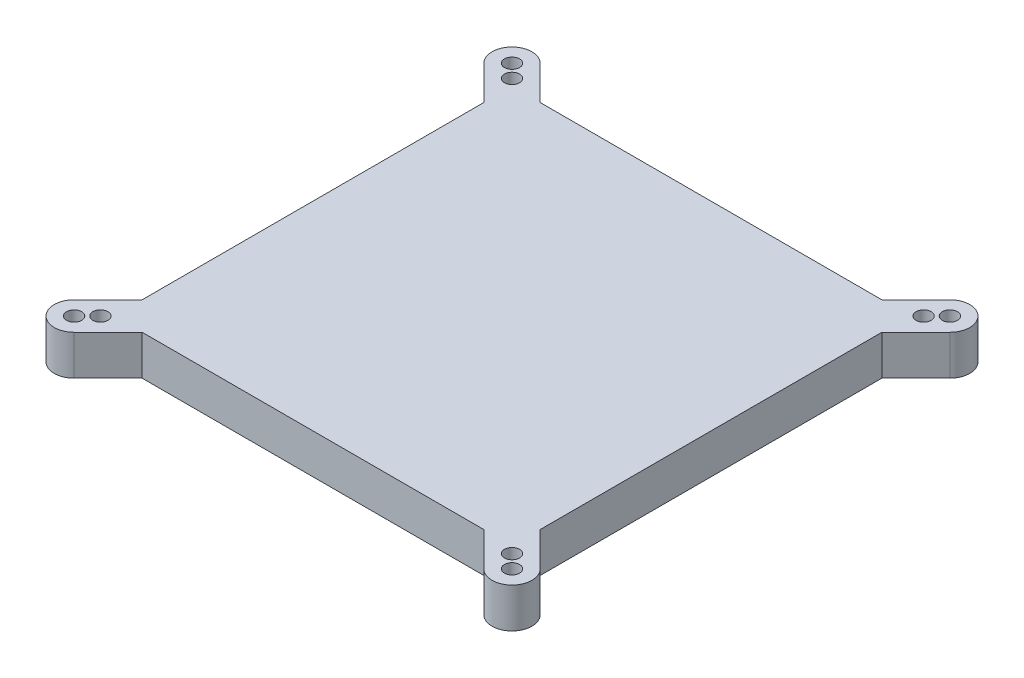
ISO-10303-21;
HEADER;
FILE_DESCRIPTION(('STEP AP214'),'2;1');
FILE_NAME('part.step','',(''),(''),'','','');
FILE_SCHEMA(('AUTOMOTIVE_DESIGN { 1 0 10303 214 1 1 1 1 }'));
ENDSEC;
DATA;
#1=APPLICATION_CONTEXT('core data for automotive mechanical design processes');
#2=APPLICATION_PROTOCOL_DEFINITION('international standard','automotive_design',2000,#1);
#3=PRODUCT_CONTEXT('',#1,'mechanical');
#4=PRODUCT('Part','Part','',(#3));
#5=PRODUCT_RELATED_PRODUCT_CATEGORY('part','',(#4));
#6=PRODUCT_DEFINITION_FORMATION('','',#4);
#7=PRODUCT_DEFINITION_CONTEXT('part definition',#1,'design');
#8=PRODUCT_DEFINITION('design','',#6,#7);
#9=PRODUCT_DEFINITION_SHAPE('','',#8);
#10=(LENGTH_UNIT() NAMED_UNIT(*) SI_UNIT(.MILLI.,.METRE.));
#11=(NAMED_UNIT(*) PLANE_ANGLE_UNIT() SI_UNIT($,.RADIAN.));
#12=(NAMED_UNIT(*) SI_UNIT($,.STERADIAN.) SOLID_ANGLE_UNIT());
#13=UNCERTAINTY_MEASURE_WITH_UNIT(LENGTH_MEASURE(1.E-05),#10,'distance_accuracy_value','');
#14=(GEOMETRIC_REPRESENTATION_CONTEXT(3) GLOBAL_UNCERTAINTY_ASSIGNED_CONTEXT((#13)) GLOBAL_UNIT_ASSIGNED_CONTEXT((#10,
#11,#12)) REPRESENTATION_CONTEXT('',''));
#15=CARTESIAN_POINT('',(0.,0.,0.));
#16=DIRECTION('',(0.,0.,1.));
#17=DIRECTION('',(1.,0.,0.));
#18=AXIS2_PLACEMENT_3D('',#15,#16,#17);
#19=CARTESIAN_POINT('',(200.,20.,0.));
#20=DIRECTION('',(-1.,0.,0.));
#21=DIRECTION('',(0.,0.,1.));
#22=AXIS2_PLACEMENT_3D('',#19,#20,#21);
#23=PLANE('',#22);
#24=DIRECTION('',(0.,-1.,0.));
#25=VECTOR('',#24,1.);
#26=CARTESIAN_POINT('',(200.,68.3076870304613,-185.857864376269));
#27=LINE('',#26,#25);
#28=CARTESIAN_POINT('',(200.,20.,-185.857864376269));
#29=VERTEX_POINT('',#28);
#30=CARTESIAN_POINT('',(200.,0.,-185.857864376269));
#31=VERTEX_POINT('',#30);
#32=EDGE_CURVE('E226',#29,#31,#27,.T.);
#33=ORIENTED_EDGE('',*,*,#32,.F.);
#34=DIRECTION('',(0.,0.,-1.));
#35=VECTOR('',#34,1.);
#36=CARTESIAN_POINT('',(200.,20.,0.));
#37=LINE('',#36,#35);
#38=CARTESIAN_POINT('',(200.,20.,-14.142135623731));
#39=VERTEX_POINT('',#38);
#40=EDGE_CURVE('E48',#39,#29,#37,.T.);
#41=ORIENTED_EDGE('',*,*,#40,.F.);
#42=DIRECTION('',(0.,-1.,0.));
#43=VECTOR('',#42,1.);
#44=CARTESIAN_POINT('',(200.,68.3076870304613,-14.142135623731));
#45=LINE('',#44,#43);
#46=CARTESIAN_POINT('',(200.,0.,-14.142135623731));
#47=VERTEX_POINT('',#46);
#48=EDGE_CURVE('E255',#39,#47,#45,.T.);
#49=ORIENTED_EDGE('',*,*,#48,.T.);
#50=DIRECTION('',(0.,0.,-1.));
#51=VECTOR('',#50,1.);
#52=CARTESIAN_POINT('',(200.,0.,0.));
#53=LINE('',#52,#51);
#54=EDGE_CURVE('E317',#47,#31,#53,.T.);
#55=ORIENTED_EDGE('',*,*,#54,.T.);
#56=EDGE_LOOP('',(#33,#41,#49,#55));
#57=FACE_BOUND('',#56,.T.);
#58=ADVANCED_FACE('F39',(#57),#23,.F.);
#59=CARTESIAN_POINT('',(0.,20.,-200.));
#60=DIRECTION('',(0.,0.,1.));
#61=DIRECTION('',(1.,0.,0.));
#62=AXIS2_PLACEMENT_3D('',#59,#60,#61);
#63=PLANE('',#62);
#64=DIRECTION('',(-1.,0.,0.));
#65=VECTOR('',#64,1.);
#66=CARTESIAN_POINT('',(0.,0.,-200.));
#67=LINE('',#66,#65);
#68=CARTESIAN_POINT('',(185.857864376269,0.,-200.));
#69=VERTEX_POINT('',#68);
#70=CARTESIAN_POINT('',(14.1421356237309,0.,-200.));
#71=VERTEX_POINT('',#70);
#72=EDGE_CURVE('E43',#69,#71,#67,.T.);
#73=ORIENTED_EDGE('',*,*,#72,.T.);
#74=DIRECTION('',(0.,-1.,0.));
#75=VECTOR('',#74,1.);
#76=CARTESIAN_POINT('',(14.142135623731,68.3076870304613,-200.));
#77=LINE('',#76,#75);
#78=CARTESIAN_POINT('',(14.1421356237309,20.,-200.));
#79=VERTEX_POINT('',#78);
#80=EDGE_CURVE('E64',#79,#71,#77,.T.);
#81=ORIENTED_EDGE('',*,*,#80,.F.);
#82=DIRECTION('',(-1.,0.,0.));
#83=VECTOR('',#82,1.);
#84=CARTESIAN_POINT('',(0.,20.,-200.));
#85=LINE('',#84,#83);
#86=CARTESIAN_POINT('',(185.857864376269,20.,-200.));
#87=VERTEX_POINT('',#86);
#88=EDGE_CURVE('E11',#87,#79,#85,.T.);
#89=ORIENTED_EDGE('',*,*,#88,.F.);
#90=DIRECTION('',(0.,-1.,0.));
#91=VECTOR('',#90,1.);
#92=CARTESIAN_POINT('',(185.857864376269,68.3076870304613,-200.));
#93=LINE('',#92,#91);
#94=EDGE_CURVE('E223',#87,#69,#93,.T.);
#95=ORIENTED_EDGE('',*,*,#94,.T.);
#96=EDGE_LOOP('',(#73,#81,#89,#95));
#97=FACE_BOUND('',#96,.T.);
#98=ADVANCED_FACE('F320',(#97),#63,.F.);
#99=CARTESIAN_POINT('',(0.,20.,0.));
#100=DIRECTION('',(1.,0.,0.));
#101=DIRECTION('',(0.,0.,-1.));
#102=AXIS2_PLACEMENT_3D('',#99,#100,#101);
#103=PLANE('',#102);
#104=DIRECTION('',(0.,0.,1.));
#105=VECTOR('',#104,1.);
#106=CARTESIAN_POINT('',(0.,20.,0.));
#107=LINE('',#106,#105);
#108=CARTESIAN_POINT('',(0.,20.,-185.857864376269));
#109=VERTEX_POINT('',#108);
#110=CARTESIAN_POINT('',(0.,20.,-14.142135623731));
#111=VERTEX_POINT('',#110);
#112=EDGE_CURVE('E56',#109,#111,#107,.T.);
#113=ORIENTED_EDGE('',*,*,#112,.F.);
#114=DIRECTION('',(0.,-1.,0.));
#115=VECTOR('',#114,1.);
#116=CARTESIAN_POINT('',(0.,68.3076870304613,-185.857864376269));
#117=LINE('',#116,#115);
#118=CARTESIAN_POINT('',(0.,0.,-185.857864376269));
#119=VERTEX_POINT('',#118);
#120=EDGE_CURVE('E170',#109,#119,#117,.T.);
#121=ORIENTED_EDGE('',*,*,#120,.T.);
#122=DIRECTION('',(0.,0.,1.));
#123=VECTOR('',#122,1.);
#124=CARTESIAN_POINT('',(0.,0.,0.));
#125=LINE('',#124,#123);
#126=CARTESIAN_POINT('',(0.,0.,-14.142135623731));
#127=VERTEX_POINT('',#126);
#128=EDGE_CURVE('E282',#119,#127,#125,.T.);
#129=ORIENTED_EDGE('',*,*,#128,.T.);
#130=DIRECTION('',(0.,-1.,0.));
#131=VECTOR('',#130,1.);
#132=CARTESIAN_POINT('',(0.,68.3076870304613,-14.142135623731));
#133=LINE('',#132,#131);
#134=EDGE_CURVE('E303',#111,#127,#133,.T.);
#135=ORIENTED_EDGE('',*,*,#134,.F.);
#136=EDGE_LOOP('',(#113,#121,#129,#135));
#137=FACE_BOUND('',#136,.T.);
#138=ADVANCED_FACE('F41',(#137),#103,.F.);
#139=CARTESIAN_POINT('',(0.,20.,0.));
#140=DIRECTION('',(0.,0.,-1.));
#141=DIRECTION('',(-1.,0.,0.));
#142=AXIS2_PLACEMENT_3D('',#139,#140,#141);
#143=PLANE('',#142);
#144=DIRECTION('',(1.,0.,0.));
#145=VECTOR('',#144,1.);
#146=CARTESIAN_POINT('',(0.,0.,0.));
#147=LINE('',#146,#145);
#148=CARTESIAN_POINT('',(14.142135623731,0.,0.));
#149=VERTEX_POINT('',#148);
#150=CARTESIAN_POINT('',(185.857864376269,0.,0.));
#151=VERTEX_POINT('',#150);
#152=EDGE_CURVE('E316',#149,#151,#147,.T.);
#153=ORIENTED_EDGE('',*,*,#152,.T.);
#154=DIRECTION('',(0.,-1.,0.));
#155=VECTOR('',#154,1.);
#156=CARTESIAN_POINT('',(185.857864376269,68.3076870304613,0.));
#157=LINE('',#156,#155);
#158=CARTESIAN_POINT('',(185.857864376269,20.,0.));
#159=VERTEX_POINT('',#158);
#160=EDGE_CURVE('E248',#159,#151,#157,.T.);
#161=ORIENTED_EDGE('',*,*,#160,.F.);
#162=DIRECTION('',(1.,0.,0.));
#163=VECTOR('',#162,1.);
#164=CARTESIAN_POINT('',(0.,20.,0.));
#165=LINE('',#164,#163);
#166=CARTESIAN_POINT('',(14.142135623731,20.,0.));
#167=VERTEX_POINT('',#166);
#168=EDGE_CURVE('E310',#167,#159,#165,.T.);
#169=ORIENTED_EDGE('',*,*,#168,.F.);
#170=DIRECTION('',(0.,-1.,0.));
#171=VECTOR('',#170,1.);
#172=CARTESIAN_POINT('',(14.142135623731,68.3076870304613,0.));
#173=LINE('',#172,#171);
#174=EDGE_CURVE('E300',#167,#149,#173,.T.);
#175=ORIENTED_EDGE('',*,*,#174,.T.);
#176=EDGE_LOOP('',(#153,#161,#169,#175));
#177=FACE_BOUND('',#176,.T.);
#178=ADVANCED_FACE('F363',(#177),#143,.F.);
#179=CARTESIAN_POINT('',(0.,20.,0.));
#180=DIRECTION('',(0.,-1.,0.));
#181=DIRECTION('',(0.,0.,-1.));
#182=AXIS2_PLACEMENT_3D('',#179,#180,#181);
#183=PLANE('',#182);
#184=DIRECTION('',(0.707106781186547,0.,0.707106781186548));
#185=VECTOR('',#184,1.);
#186=CARTESIAN_POINT('',(-7.07106781186548,20.,-192.928932188135));
#187=LINE('',#186,#185);
#188=CARTESIAN_POINT('',(-17.0876252708111,20.,-202.94548964708));
#189=VERTEX_POINT('',#188);
#190=EDGE_CURVE('E156',#189,#109,#187,.T.);
#191=ORIENTED_EDGE('',*,*,#190,.T.);
#192=ORIENTED_EDGE('',*,*,#112,.T.);
#193=DIRECTION('',(0.707106781186547,0.,-0.707106781186548));
#194=VECTOR('',#193,1.);
#195=CARTESIAN_POINT('',(-7.07106781186548,20.,-7.07106781186547));
#196=LINE('',#195,#194);
#197=CARTESIAN_POINT('',(-17.0876252708111,20.,2.94548964708019));
#198=VERTEX_POINT('',#197);
#199=EDGE_CURVE('E273',#198,#111,#196,.T.);
#200=ORIENTED_EDGE('',*,*,#199,.F.);
#201=CARTESIAN_POINT('',(-10.0165574589457,20.,10.0165574589457));
#202=DIRECTION('',(0.,-1.,0.));
#203=DIRECTION('',(0.,0.,-1.));
#204=AXIS2_PLACEMENT_3D('',#201,#202,#203);
#205=CIRCLE('',#204,10.);
#206=CARTESIAN_POINT('',(-2.9454896470802,20.,17.0876252708111));
#207=VERTEX_POINT('',#206);
#208=EDGE_CURVE('E272',#207,#198,#205,.T.);
#209=ORIENTED_EDGE('',*,*,#208,.F.);
#210=DIRECTION('',(-0.707106781186548,0.,0.707106781186547));
#211=VECTOR('',#210,1.);
#212=CARTESIAN_POINT('',(7.07106781186548,20.,7.07106781186548));
#213=LINE('',#212,#211);
#214=EDGE_CURVE('E269',#167,#207,#213,.T.);
#215=ORIENTED_EDGE('',*,*,#214,.F.);
#216=ORIENTED_EDGE('',*,*,#168,.T.);
#217=DIRECTION('',(0.707106781186548,0.,0.707106781186547));
#218=VECTOR('',#217,1.);
#219=CARTESIAN_POINT('',(192.928932188135,20.,7.07106781186548));
#220=LINE('',#219,#218);
#221=CARTESIAN_POINT('',(202.94548964708,20.,17.0876252708111));
#222=VERTEX_POINT('',#221);
#223=EDGE_CURVE('E249',#159,#222,#220,.T.);
#224=ORIENTED_EDGE('',*,*,#223,.T.);
#225=CARTESIAN_POINT('',(210.016557458946,20.,10.0165574589457));
#226=DIRECTION('',(0.,-1.,0.));
#227=DIRECTION('',(0.,0.,-1.));
#228=AXIS2_PLACEMENT_3D('',#225,#226,#227);
#229=CIRCLE('',#228,10.);
#230=CARTESIAN_POINT('',(217.087625270811,20.,2.94548964708019));
#231=VERTEX_POINT('',#230);
#232=EDGE_CURVE('E265',#222,#231,#229,.F.);
#233=ORIENTED_EDGE('',*,*,#232,.T.);
#234=DIRECTION('',(-0.707106781186547,0.,-0.707106781186548));
#235=VECTOR('',#234,1.);
#236=CARTESIAN_POINT('',(207.071067811865,20.,-7.07106781186547));
#237=LINE('',#236,#235);
#238=EDGE_CURVE('E252',#231,#39,#237,.T.);
#239=ORIENTED_EDGE('',*,*,#238,.T.);
#240=ORIENTED_EDGE('',*,*,#40,.T.);
#241=DIRECTION('',(-0.707106781186547,0.,0.707106781186548));
#242=VECTOR('',#241,1.);
#243=CARTESIAN_POINT('',(207.071067811865,20.,-192.928932188135));
#244=LINE('',#243,#242);
#245=CARTESIAN_POINT('',(217.087625270811,20.,-202.94548964708));
#246=VERTEX_POINT('',#245);
#247=EDGE_CURVE('E195',#246,#29,#244,.T.);
#248=ORIENTED_EDGE('',*,*,#247,.F.);
#249=CARTESIAN_POINT('',(210.016557458946,20.,-210.016557458946));
#250=DIRECTION('',(0.,-1.,0.));
#251=DIRECTION('',(0.,0.,-1.));
#252=AXIS2_PLACEMENT_3D('',#249,#250,#251);
#253=CIRCLE('',#252,10.);
#254=CARTESIAN_POINT('',(202.94548964708,20.,-217.087625270811));
#255=VERTEX_POINT('',#254);
#256=EDGE_CURVE('E194',#255,#246,#253,.T.);
#257=ORIENTED_EDGE('',*,*,#256,.F.);
#258=DIRECTION('',(0.707106781186548,0.,-0.707106781186547));
#259=VECTOR('',#258,1.);
#260=CARTESIAN_POINT('',(192.928932188135,20.,-207.071067811865));
#261=LINE('',#260,#259);
#262=EDGE_CURVE('E191',#87,#255,#261,.T.);
#263=ORIENTED_EDGE('',*,*,#262,.F.);
#264=ORIENTED_EDGE('',*,*,#88,.T.);
#265=DIRECTION('',(-0.707106781186548,0.,-0.707106781186547));
#266=VECTOR('',#265,1.);
#267=CARTESIAN_POINT('',(7.07106781186548,20.,-207.071067811865));
#268=LINE('',#267,#266);
#269=CARTESIAN_POINT('',(-2.9454896470802,20.,-217.087625270811));
#270=VERTEX_POINT('',#269);
#271=EDGE_CURVE('E159',#79,#270,#268,.T.);
#272=ORIENTED_EDGE('',*,*,#271,.T.);
#273=CARTESIAN_POINT('',(-10.0165574589457,20.,-210.016557458946));
#274=DIRECTION('',(0.,-1.,0.));
#275=DIRECTION('',(0.,0.,-1.));
#276=AXIS2_PLACEMENT_3D('',#273,#274,#275);
#277=CIRCLE('',#276,10.);
#278=EDGE_CURVE('E152',#270,#189,#277,.F.);
#279=ORIENTED_EDGE('',*,*,#278,.T.);
#280=EDGE_LOOP('',(#191,#192,#200,#209,#215,#216,#224,#233,#239,#240,#248,#257,#263,#264,#272,#279));
#281=FACE_BOUND('',#280,.T.);
#282=CARTESIAN_POINT('',(-3.41536736099135,20.,3.41536736099135));
#283=DIRECTION('',(0.,-1.,0.));
#284=DIRECTION('',(0.,0.,-1.));
#285=AXIS2_PLACEMENT_3D('',#282,#283,#284);
#286=CIRCLE('',#285,3.79708670005155);
#287=CARTESIAN_POINT('',(-3.41536736099135,20.,-0.381719339060196));
#288=VERTEX_POINT('',#287);
#289=EDGE_CURVE('E276',#288,#288,#286,.F.);
#290=ORIENTED_EDGE('',*,*,#289,.F.);
#291=EDGE_LOOP('',(#290));
#292=FACE_BOUND('',#291,.T.);
#293=CARTESIAN_POINT('',(-10.0165574589457,20.,10.0165574589457));
#294=DIRECTION('',(0.,-1.,0.));
#295=DIRECTION('',(0.,0.,-1.));
#296=AXIS2_PLACEMENT_3D('',#293,#294,#295);
#297=CIRCLE('',#296,3.79708670005155);
#298=CARTESIAN_POINT('',(-10.0165574589457,20.,6.21947075889412));
#299=VERTEX_POINT('',#298);
#300=EDGE_CURVE('E279',#299,#299,#297,.F.);
#301=ORIENTED_EDGE('',*,*,#300,.F.);
#302=EDGE_LOOP('',(#301));
#303=FACE_BOUND('',#302,.T.);
#304=CARTESIAN_POINT('',(210.016557458946,20.,10.0165574589457));
#305=DIRECTION('',(0.,-1.,0.));
#306=DIRECTION('',(0.,0.,-1.));
#307=AXIS2_PLACEMENT_3D('',#304,#305,#306);
#308=CIRCLE('',#307,3.79708670005155);
#309=CARTESIAN_POINT('',(210.016557458946,20.,6.21947075889412));
#310=VERTEX_POINT('',#309);
#311=EDGE_CURVE('E235',#310,#310,#308,.T.);
#312=ORIENTED_EDGE('',*,*,#311,.T.);
#313=EDGE_LOOP('',(#312));
#314=FACE_BOUND('',#313,.T.);
#315=CARTESIAN_POINT('',(203.415367360991,20.,3.41536736099135));
#316=DIRECTION('',(0.,-1.,0.));
#317=DIRECTION('',(0.,0.,-1.));
#318=AXIS2_PLACEMENT_3D('',#315,#316,#317);
#319=CIRCLE('',#318,3.79708670005155);
#320=CARTESIAN_POINT('',(203.415367360991,20.,-0.381719339060196));
#321=VERTEX_POINT('',#320);
#322=EDGE_CURVE('E262',#321,#321,#319,.T.);
#323=ORIENTED_EDGE('',*,*,#322,.T.);
#324=EDGE_LOOP('',(#323));
#325=FACE_BOUND('',#324,.T.);
#326=CARTESIAN_POINT('',(203.415367360991,20.,-203.415367360991));
#327=DIRECTION('',(0.,-1.,0.));
#328=DIRECTION('',(0.,0.,-1.));
#329=AXIS2_PLACEMENT_3D('',#326,#327,#328);
#330=CIRCLE('',#329,3.79708670005155);
#331=CARTESIAN_POINT('',(203.415367360991,20.,-207.212454061043));
#332=VERTEX_POINT('',#331);
#333=EDGE_CURVE('E198',#332,#332,#330,.F.);
#334=ORIENTED_EDGE('',*,*,#333,.F.);
#335=EDGE_LOOP('',(#334));
#336=FACE_BOUND('',#335,.T.);
#337=CARTESIAN_POINT('',(210.016557458946,20.,-210.016557458946));
#338=DIRECTION('',(0.,-1.,0.));
#339=DIRECTION('',(0.,0.,-1.));
#340=AXIS2_PLACEMENT_3D('',#337,#338,#339);
#341=CIRCLE('',#340,3.79708670005155);
#342=CARTESIAN_POINT('',(210.016557458946,20.,-213.813644158997));
#343=VERTEX_POINT('',#342);
#344=EDGE_CURVE('E201',#343,#343,#341,.F.);
#345=ORIENTED_EDGE('',*,*,#344,.F.);
#346=EDGE_LOOP('',(#345));
#347=FACE_BOUND('',#346,.T.);
#348=CARTESIAN_POINT('',(-10.0165574589457,20.,-210.016557458946));
#349=DIRECTION('',(0.,-1.,0.));
#350=DIRECTION('',(0.,0.,-1.));
#351=AXIS2_PLACEMENT_3D('',#348,#349,#350);
#352=CIRCLE('',#351,3.79708670005155);
#353=CARTESIAN_POINT('',(-10.0165574589457,20.,-213.813644158997));
#354=VERTEX_POINT('',#353);
#355=EDGE_CURVE('E185',#354,#354,#352,.T.);
#356=ORIENTED_EDGE('',*,*,#355,.T.);
#357=EDGE_LOOP('',(#356));
#358=FACE_BOUND('',#357,.T.);
#359=CARTESIAN_POINT('',(-3.41536736099135,20.,-203.415367360991));
#360=DIRECTION('',(0.,-1.,0.));
#361=DIRECTION('',(0.,0.,-1.));
#362=AXIS2_PLACEMENT_3D('',#359,#360,#361);
#363=CIRCLE('',#362,3.79708670005155);
#364=CARTESIAN_POINT('',(-3.41536736099135,20.,-207.212454061043));
#365=VERTEX_POINT('',#364);
#366=EDGE_CURVE('E163',#365,#365,#363,.T.);
#367=ORIENTED_EDGE('',*,*,#366,.T.);
#368=EDGE_LOOP('',(#367));
#369=FACE_BOUND('',#368,.T.);
#370=ADVANCED_FACE('F154',(#281,#292,#303,#314,#325,#336,#347,#358,#369),#183,.F.);
#371=CARTESIAN_POINT('',(0.,0.,0.));
#372=DIRECTION('',(0.,-1.,0.));
#373=DIRECTION('',(0.,0.,-1.));
#374=AXIS2_PLACEMENT_3D('',#371,#372,#373);
#375=PLANE('',#374);
#376=ORIENTED_EDGE('',*,*,#128,.F.);
#377=DIRECTION('',(-0.707106781186547,0.,-0.707106781186548));
#378=VECTOR('',#377,1.);
#379=CARTESIAN_POINT('',(-7.07106781186548,0.,-192.928932188135));
#380=LINE('',#379,#378);
#381=CARTESIAN_POINT('',(-17.0876252708111,0.,-202.94548964708));
#382=VERTEX_POINT('',#381);
#383=EDGE_CURVE('E188',#119,#382,#380,.T.);
#384=ORIENTED_EDGE('',*,*,#383,.T.);
#385=CARTESIAN_POINT('',(-10.0165574589457,0.,-210.016557458946));
#386=DIRECTION('',(0.,1.,0.));
#387=DIRECTION('',(0.,0.,1.));
#388=AXIS2_PLACEMENT_3D('',#385,#386,#387);
#389=CIRCLE('',#388,10.);
#390=CARTESIAN_POINT('',(-2.9454896470802,0.,-217.087625270811));
#391=VERTEX_POINT('',#390);
#392=EDGE_CURVE('E174',#382,#391,#389,.F.);
#393=ORIENTED_EDGE('',*,*,#392,.T.);
#394=DIRECTION('',(0.707106781186548,0.,0.707106781186547));
#395=VECTOR('',#394,1.);
#396=CARTESIAN_POINT('',(7.07106781186548,0.,-207.071067811865));
#397=LINE('',#396,#395);
#398=EDGE_CURVE('E328',#391,#71,#397,.T.);
#399=ORIENTED_EDGE('',*,*,#398,.T.);
#400=ORIENTED_EDGE('',*,*,#72,.F.);
#401=DIRECTION('',(-0.707106781186548,0.,0.707106781186547));
#402=VECTOR('',#401,1.);
#403=CARTESIAN_POINT('',(192.928932188135,0.,-207.071067811865));
#404=LINE('',#403,#402);
#405=CARTESIAN_POINT('',(202.94548964708,0.,-217.087625270811));
#406=VERTEX_POINT('',#405);
#407=EDGE_CURVE('E217',#406,#69,#404,.T.);
#408=ORIENTED_EDGE('',*,*,#407,.F.);
#409=CARTESIAN_POINT('',(210.016557458946,0.,-210.016557458946));
#410=DIRECTION('',(0.,-1.,0.));
#411=DIRECTION('',(0.,0.,1.));
#412=AXIS2_PLACEMENT_3D('',#409,#410,#411);
#413=CIRCLE('',#412,10.);
#414=CARTESIAN_POINT('',(217.087625270811,0.,-202.94548964708));
#415=VERTEX_POINT('',#414);
#416=EDGE_CURVE('E211',#415,#406,#413,.F.);
#417=ORIENTED_EDGE('',*,*,#416,.F.);
#418=DIRECTION('',(0.707106781186547,0.,-0.707106781186548));
#419=VECTOR('',#418,1.);
#420=CARTESIAN_POINT('',(207.071067811865,0.,-192.928932188135));
#421=LINE('',#420,#419);
#422=EDGE_CURVE('E214',#31,#415,#421,.T.);
#423=ORIENTED_EDGE('',*,*,#422,.F.);
#424=ORIENTED_EDGE('',*,*,#54,.F.);
#425=DIRECTION('',(0.707106781186547,0.,0.707106781186548));
#426=VECTOR('',#425,1.);
#427=CARTESIAN_POINT('',(207.071067811865,0.,-7.07106781186547));
#428=LINE('',#427,#426);
#429=CARTESIAN_POINT('',(217.087625270811,0.,2.94548964708019));
#430=VERTEX_POINT('',#429);
#431=EDGE_CURVE('E232',#47,#430,#428,.T.);
#432=ORIENTED_EDGE('',*,*,#431,.T.);
#433=CARTESIAN_POINT('',(210.016557458946,0.,10.0165574589457));
#434=DIRECTION('',(0.,1.,0.));
#435=DIRECTION('',(0.,0.,-1.));
#436=AXIS2_PLACEMENT_3D('',#433,#434,#435);
#437=CIRCLE('',#436,10.);
#438=CARTESIAN_POINT('',(202.94548964708,0.,17.0876252708111));
#439=VERTEX_POINT('',#438);
#440=EDGE_CURVE('E239',#430,#439,#437,.F.);
#441=ORIENTED_EDGE('',*,*,#440,.T.);
#442=DIRECTION('',(-0.707106781186548,0.,-0.707106781186547));
#443=VECTOR('',#442,1.);
#444=CARTESIAN_POINT('',(192.928932188135,0.,7.07106781186548));
#445=LINE('',#444,#443);
#446=EDGE_CURVE('E236',#439,#151,#445,.T.);
#447=ORIENTED_EDGE('',*,*,#446,.T.);
#448=ORIENTED_EDGE('',*,*,#152,.F.);
#449=DIRECTION('',(0.707106781186548,0.,-0.707106781186547));
#450=VECTOR('',#449,1.);
#451=CARTESIAN_POINT('',(7.07106781186548,0.,7.07106781186548));
#452=LINE('',#451,#450);
#453=CARTESIAN_POINT('',(-2.9454896470802,0.,17.0876252708111));
#454=VERTEX_POINT('',#453);
#455=EDGE_CURVE('E294',#454,#149,#452,.T.);
#456=ORIENTED_EDGE('',*,*,#455,.F.);
#457=CARTESIAN_POINT('',(-10.0165574589457,0.,10.0165574589457));
#458=DIRECTION('',(0.,-1.,0.));
#459=DIRECTION('',(0.,0.,-1.));
#460=AXIS2_PLACEMENT_3D('',#457,#458,#459);
#461=CIRCLE('',#460,10.);
#462=CARTESIAN_POINT('',(-17.0876252708111,0.,2.94548964708019));
#463=VERTEX_POINT('',#462);
#464=EDGE_CURVE('E288',#463,#454,#461,.F.);
#465=ORIENTED_EDGE('',*,*,#464,.F.);
#466=DIRECTION('',(-0.707106781186547,0.,0.707106781186548));
#467=VECTOR('',#466,1.);
#468=CARTESIAN_POINT('',(-7.07106781186548,0.,-7.07106781186547));
#469=LINE('',#468,#467);
#470=EDGE_CURVE('E291',#127,#463,#469,.T.);
#471=ORIENTED_EDGE('',*,*,#470,.F.);
#472=EDGE_LOOP('',(#376,#384,#393,#399,#400,#408,#417,#423,#424,#432,#441,#447,#448,#456,#465,#471));
#473=FACE_BOUND('',#472,.T.);
#474=CARTESIAN_POINT('',(-3.41536736099135,0.,3.41536736099135));
#475=DIRECTION('',(0.,-1.,0.));
#476=DIRECTION('',(0.,0.,-1.));
#477=AXIS2_PLACEMENT_3D('',#474,#475,#476);
#478=CIRCLE('',#477,3.79708670005155);
#479=CARTESIAN_POINT('',(-3.41536736099135,0.,-0.381719339060196));
#480=VERTEX_POINT('',#479);
#481=EDGE_CURVE('E251',#480,#480,#478,.T.);
#482=ORIENTED_EDGE('',*,*,#481,.F.);
#483=EDGE_LOOP('',(#482));
#484=FACE_BOUND('',#483,.T.);
#485=CARTESIAN_POINT('',(-10.0165574589457,0.,10.0165574589457));
#486=DIRECTION('',(0.,-1.,0.));
#487=DIRECTION('',(0.,0.,-1.));
#488=AXIS2_PLACEMENT_3D('',#485,#486,#487);
#489=CIRCLE('',#488,3.79708670005155);
#490=CARTESIAN_POINT('',(-10.0165574589457,0.,6.21947075889412));
#491=VERTEX_POINT('',#490);
#492=EDGE_CURVE('E285',#491,#491,#489,.T.);
#493=ORIENTED_EDGE('',*,*,#492,.F.);
#494=EDGE_LOOP('',(#493));
#495=FACE_BOUND('',#494,.T.);
#496=CARTESIAN_POINT('',(203.415367360991,0.,3.41536736099135));
#497=DIRECTION('',(0.,1.,0.));
#498=DIRECTION('',(0.,0.,-1.));
#499=AXIS2_PLACEMENT_3D('',#496,#497,#498);
#500=CIRCLE('',#499,3.79708670005155);
#501=CARTESIAN_POINT('',(203.415367360991,0.,-0.381719339060196));
#502=VERTEX_POINT('',#501);
#503=EDGE_CURVE('E245',#502,#502,#500,.T.);
#504=ORIENTED_EDGE('',*,*,#503,.T.);
#505=EDGE_LOOP('',(#504));
#506=FACE_BOUND('',#505,.T.);
#507=CARTESIAN_POINT('',(210.016557458946,0.,10.0165574589457));
#508=DIRECTION('',(0.,1.,0.));
#509=DIRECTION('',(0.,0.,-1.));
#510=AXIS2_PLACEMENT_3D('',#507,#508,#509);
#511=CIRCLE('',#510,3.79708670005155);
#512=CARTESIAN_POINT('',(210.016557458946,0.,6.21947075889412));
#513=VERTEX_POINT('',#512);
#514=EDGE_CURVE('E242',#513,#513,#511,.T.);
#515=ORIENTED_EDGE('',*,*,#514,.T.);
#516=EDGE_LOOP('',(#515));
#517=FACE_BOUND('',#516,.T.);
#518=CARTESIAN_POINT('',(203.415367360991,0.,-203.415367360991));
#519=DIRECTION('',(0.,-1.,0.));
#520=DIRECTION('',(0.,0.,1.));
#521=AXIS2_PLACEMENT_3D('',#518,#519,#520);
#522=CIRCLE('',#521,3.79708670005155);
#523=CARTESIAN_POINT('',(203.415367360991,0.,-199.61828066094));
#524=VERTEX_POINT('',#523);
#525=EDGE_CURVE('E205',#524,#524,#522,.T.);
#526=ORIENTED_EDGE('',*,*,#525,.F.);
#527=EDGE_LOOP('',(#526));
#528=FACE_BOUND('',#527,.T.);
#529=CARTESIAN_POINT('',(210.016557458946,0.,-210.016557458946));
#530=DIRECTION('',(0.,-1.,0.));
#531=DIRECTION('',(0.,0.,1.));
#532=AXIS2_PLACEMENT_3D('',#529,#530,#531);
#533=CIRCLE('',#532,3.79708670005155);
#534=CARTESIAN_POINT('',(210.016557458946,0.,-206.219470758894));
#535=VERTEX_POINT('',#534);
#536=EDGE_CURVE('E208',#535,#535,#533,.T.);
#537=ORIENTED_EDGE('',*,*,#536,.F.);
#538=EDGE_LOOP('',(#537));
#539=FACE_BOUND('',#538,.T.);
#540=CARTESIAN_POINT('',(-3.41536736099135,0.,-203.415367360991));
#541=DIRECTION('',(0.,1.,0.));
#542=DIRECTION('',(0.,0.,1.));
#543=AXIS2_PLACEMENT_3D('',#540,#541,#542);
#544=CIRCLE('',#543,3.79708670005155);
#545=CARTESIAN_POINT('',(-3.41536736099135,0.,-199.61828066094));
#546=VERTEX_POINT('',#545);
#547=EDGE_CURVE('E183',#546,#546,#544,.T.);
#548=ORIENTED_EDGE('',*,*,#547,.T.);
#549=EDGE_LOOP('',(#548));
#550=FACE_BOUND('',#549,.T.);
#551=CARTESIAN_POINT('',(-10.0165574589457,0.,-210.016557458946));
#552=DIRECTION('',(0.,1.,0.));
#553=DIRECTION('',(0.,0.,1.));
#554=AXIS2_PLACEMENT_3D('',#551,#552,#553);
#555=CIRCLE('',#554,3.79708670005155);
#556=CARTESIAN_POINT('',(-10.0165574589457,0.,-206.219470758894));
#557=VERTEX_POINT('',#556);
#558=EDGE_CURVE('E334',#557,#557,#555,.T.);
#559=ORIENTED_EDGE('',*,*,#558,.T.);
#560=EDGE_LOOP('',(#559));
#561=FACE_BOUND('',#560,.T.);
#562=ADVANCED_FACE('F330',(#473,#484,#495,#506,#517,#528,#539,#550,#561),#375,.T.);
#563=CARTESIAN_POINT('',(-10.0165574589457,68.3076870304613,10.0165574589457));
#564=DIRECTION('',(0.,-1.,0.));
#565=DIRECTION('',(0.,0.,-1.));
#566=AXIS2_PLACEMENT_3D('',#563,#564,#565);
#567=CYLINDRICAL_SURFACE('',#566,3.79708670005155);
#568=ORIENTED_EDGE('',*,*,#300,.T.);
#569=EDGE_LOOP('',(#568));
#570=FACE_BOUND('',#569,.T.);
#571=ORIENTED_EDGE('',*,*,#492,.T.);
#572=EDGE_LOOP('',(#571));
#573=FACE_BOUND('',#572,.T.);
#574=ADVANCED_FACE('F445',(#570,#573),#567,.F.);
#575=CARTESIAN_POINT('',(-3.41536736099135,68.3076870304613,3.41536736099135));
#576=DIRECTION('',(0.,-1.,0.));
#577=DIRECTION('',(0.,0.,-1.));
#578=AXIS2_PLACEMENT_3D('',#575,#576,#577);
#579=CYLINDRICAL_SURFACE('',#578,3.79708670005155);
#580=ORIENTED_EDGE('',*,*,#289,.T.);
#581=EDGE_LOOP('',(#580));
#582=FACE_BOUND('',#581,.T.);
#583=ORIENTED_EDGE('',*,*,#481,.T.);
#584=EDGE_LOOP('',(#583));
#585=FACE_BOUND('',#584,.T.);
#586=ADVANCED_FACE('F440',(#582,#585),#579,.F.);
#587=CARTESIAN_POINT('',(-7.07106781186548,68.3076870304613,-7.07106781186547));
#588=DIRECTION('',(0.707106781186548,0.,0.707106781186547));
#589=DIRECTION('',(0.707106781186547,0.,-0.707106781186548));
#590=AXIS2_PLACEMENT_3D('',#587,#588,#589);
#591=PLANE('',#590);
#592=DIRECTION('',(0.,-1.,0.));
#593=VECTOR('',#592,1.);
#594=CARTESIAN_POINT('',(-17.0876252708111,68.3076870304613,2.94548964708019));
#595=LINE('',#594,#593);
#596=EDGE_CURVE('E297',#198,#463,#595,.T.);
#597=ORIENTED_EDGE('',*,*,#596,.F.);
#598=ORIENTED_EDGE('',*,*,#199,.T.);
#599=ORIENTED_EDGE('',*,*,#134,.T.);
#600=ORIENTED_EDGE('',*,*,#470,.T.);
#601=EDGE_LOOP('',(#597,#598,#599,#600));
#602=FACE_BOUND('',#601,.T.);
#603=ADVANCED_FACE('F436',(#602),#591,.F.);
#604=CARTESIAN_POINT('',(7.07106781186548,68.3076870304613,7.07106781186548));
#605=DIRECTION('',(-0.707106781186547,0.,-0.707106781186548));
#606=DIRECTION('',(-0.707106781186548,0.,0.707106781186547));
#607=AXIS2_PLACEMENT_3D('',#604,#605,#606);
#608=PLANE('',#607);
#609=ORIENTED_EDGE('',*,*,#174,.F.);
#610=ORIENTED_EDGE('',*,*,#214,.T.);
#611=DIRECTION('',(0.,-1.,0.));
#612=VECTOR('',#611,1.);
#613=CARTESIAN_POINT('',(-2.9454896470802,68.3076870304613,17.0876252708111));
#614=LINE('',#613,#612);
#615=EDGE_CURVE('E298',#207,#454,#614,.T.);
#616=ORIENTED_EDGE('',*,*,#615,.T.);
#617=ORIENTED_EDGE('',*,*,#455,.T.);
#618=EDGE_LOOP('',(#609,#610,#616,#617));
#619=FACE_BOUND('',#618,.T.);
#620=ADVANCED_FACE('F433',(#619),#608,.F.);
#621=CARTESIAN_POINT('',(-10.0165574589457,68.3076870304613,10.0165574589457));
#622=DIRECTION('',(0.,-1.,0.));
#623=DIRECTION('',(0.,0.,-1.));
#624=AXIS2_PLACEMENT_3D('',#621,#622,#623);
#625=CYLINDRICAL_SURFACE('',#624,10.);
#626=ORIENTED_EDGE('',*,*,#615,.F.);
#627=ORIENTED_EDGE('',*,*,#208,.T.);
#628=ORIENTED_EDGE('',*,*,#596,.T.);
#629=ORIENTED_EDGE('',*,*,#464,.T.);
#630=EDGE_LOOP('',(#626,#627,#628,#629));
#631=FACE_BOUND('',#630,.T.);
#632=ADVANCED_FACE('F432',(#631),#625,.T.);
#633=CARTESIAN_POINT('',(210.016557458946,68.3076870304613,10.0165574589457));
#634=DIRECTION('',(0.,-1.,0.));
#635=DIRECTION('',(0.,0.,-1.));
#636=AXIS2_PLACEMENT_3D('',#633,#634,#635);
#637=CYLINDRICAL_SURFACE('',#636,10.);
#638=ORIENTED_EDGE('',*,*,#232,.F.);
#639=DIRECTION('',(0.,-1.,0.));
#640=VECTOR('',#639,1.);
#641=CARTESIAN_POINT('',(202.94548964708,68.3076870304613,17.0876252708111));
#642=LINE('',#641,#640);
#643=EDGE_CURVE('E204',#222,#439,#642,.T.);
#644=ORIENTED_EDGE('',*,*,#643,.T.);
#645=ORIENTED_EDGE('',*,*,#440,.F.);
#646=DIRECTION('',(0.,-1.,0.));
#647=VECTOR('',#646,1.);
#648=CARTESIAN_POINT('',(217.087625270811,68.3076870304613,2.94548964708019));
#649=LINE('',#648,#647);
#650=EDGE_CURVE('E253',#231,#430,#649,.T.);
#651=ORIENTED_EDGE('',*,*,#650,.F.);
#652=EDGE_LOOP('',(#638,#644,#645,#651));
#653=FACE_BOUND('',#652,.T.);
#654=ADVANCED_FACE('F383',(#653),#637,.T.);
#655=CARTESIAN_POINT('',(207.071067811865,68.3076870304613,-7.07106781186547));
#656=DIRECTION('',(0.707106781186548,0.,-0.707106781186547));
#657=DIRECTION('',(-0.707106781186547,0.,-0.707106781186548));
#658=AXIS2_PLACEMENT_3D('',#655,#656,#657);
#659=PLANE('',#658);
#660=ORIENTED_EDGE('',*,*,#238,.F.);
#661=ORIENTED_EDGE('',*,*,#650,.T.);
#662=ORIENTED_EDGE('',*,*,#431,.F.);
#663=ORIENTED_EDGE('',*,*,#48,.F.);
#664=EDGE_LOOP('',(#660,#661,#662,#663));
#665=FACE_BOUND('',#664,.T.);
#666=ADVANCED_FACE('F387',(#665),#659,.T.);
#667=CARTESIAN_POINT('',(210.016557458946,68.3076870304613,10.0165574589457));
#668=DIRECTION('',(0.,-1.,0.));
#669=DIRECTION('',(0.,0.,-1.));
#670=AXIS2_PLACEMENT_3D('',#667,#668,#669);
#671=CYLINDRICAL_SURFACE('',#670,3.79708670005155);
#672=ORIENTED_EDGE('',*,*,#311,.F.);
#673=EDGE_LOOP('',(#672));
#674=FACE_BOUND('',#673,.T.);
#675=ORIENTED_EDGE('',*,*,#514,.F.);
#676=EDGE_LOOP('',(#675));
#677=FACE_BOUND('',#676,.T.);
#678=ADVANCED_FACE('F418',(#674,#677),#671,.F.);
#679=CARTESIAN_POINT('',(203.415367360991,68.3076870304613,3.41536736099135));
#680=DIRECTION('',(0.,-1.,0.));
#681=DIRECTION('',(0.,0.,-1.));
#682=AXIS2_PLACEMENT_3D('',#679,#680,#681);
#683=CYLINDRICAL_SURFACE('',#682,3.79708670005155);
#684=ORIENTED_EDGE('',*,*,#322,.F.);
#685=EDGE_LOOP('',(#684));
#686=FACE_BOUND('',#685,.T.);
#687=ORIENTED_EDGE('',*,*,#503,.F.);
#688=EDGE_LOOP('',(#687));
#689=FACE_BOUND('',#688,.T.);
#690=ADVANCED_FACE('F421',(#686,#689),#683,.F.);
#691=CARTESIAN_POINT('',(192.928932188135,68.3076870304613,7.07106781186548));
#692=DIRECTION('',(-0.707106781186547,0.,0.707106781186548));
#693=DIRECTION('',(0.707106781186548,0.,0.707106781186547));
#694=AXIS2_PLACEMENT_3D('',#691,#692,#693);
#695=PLANE('',#694);
#696=ORIENTED_EDGE('',*,*,#223,.F.);
#697=ORIENTED_EDGE('',*,*,#160,.T.);
#698=ORIENTED_EDGE('',*,*,#446,.F.);
#699=ORIENTED_EDGE('',*,*,#643,.F.);
#700=EDGE_LOOP('',(#696,#697,#698,#699));
#701=FACE_BOUND('',#700,.T.);
#702=ADVANCED_FACE('F376',(#701),#695,.T.);
#703=CARTESIAN_POINT('',(210.016557458946,68.3076870304613,-210.016557458946));
#704=DIRECTION('',(0.,-1.,0.));
#705=DIRECTION('',(0.,0.,-1.));
#706=AXIS2_PLACEMENT_3D('',#703,#704,#705);
#707=CYLINDRICAL_SURFACE('',#706,3.79708670005155);
#708=ORIENTED_EDGE('',*,*,#344,.T.);
#709=EDGE_LOOP('',(#708));
#710=FACE_BOUND('',#709,.T.);
#711=ORIENTED_EDGE('',*,*,#536,.T.);
#712=EDGE_LOOP('',(#711));
#713=FACE_BOUND('',#712,.T.);
#714=ADVANCED_FACE('F411',(#710,#713),#707,.F.);
#715=CARTESIAN_POINT('',(203.415367360991,68.3076870304613,-203.415367360991));
#716=DIRECTION('',(0.,-1.,0.));
#717=DIRECTION('',(0.,0.,-1.));
#718=AXIS2_PLACEMENT_3D('',#715,#716,#717);
#719=CYLINDRICAL_SURFACE('',#718,3.79708670005155);
#720=ORIENTED_EDGE('',*,*,#333,.T.);
#721=EDGE_LOOP('',(#720));
#722=FACE_BOUND('',#721,.T.);
#723=ORIENTED_EDGE('',*,*,#525,.T.);
#724=EDGE_LOOP('',(#723));
#725=FACE_BOUND('',#724,.T.);
#726=ADVANCED_FACE('F406',(#722,#725),#719,.F.);
#727=CARTESIAN_POINT('',(207.071067811865,68.3076870304613,-192.928932188135));
#728=DIRECTION('',(-0.707106781186548,0.,-0.707106781186547));
#729=DIRECTION('',(-0.707106781186547,0.,0.707106781186548));
#730=AXIS2_PLACEMENT_3D('',#727,#728,#729);
#731=PLANE('',#730);
#732=DIRECTION('',(0.,-1.,0.));
#733=VECTOR('',#732,1.);
#734=CARTESIAN_POINT('',(217.087625270811,68.3076870304613,-202.94548964708));
#735=LINE('',#734,#733);
#736=EDGE_CURVE('E220',#246,#415,#735,.T.);
#737=ORIENTED_EDGE('',*,*,#736,.F.);
#738=ORIENTED_EDGE('',*,*,#247,.T.);
#739=ORIENTED_EDGE('',*,*,#32,.T.);
#740=ORIENTED_EDGE('',*,*,#422,.T.);
#741=EDGE_LOOP('',(#737,#738,#739,#740));
#742=FACE_BOUND('',#741,.T.);
#743=ADVANCED_FACE('F392',(#742),#731,.F.);
#744=CARTESIAN_POINT('',(192.928932188135,68.3076870304613,-207.071067811865));
#745=DIRECTION('',(0.707106781186547,0.,0.707106781186548));
#746=DIRECTION('',(0.707106781186548,0.,-0.707106781186547));
#747=AXIS2_PLACEMENT_3D('',#744,#745,#746);
#748=PLANE('',#747);
#749=ORIENTED_EDGE('',*,*,#94,.F.);
#750=ORIENTED_EDGE('',*,*,#262,.T.);
#751=DIRECTION('',(0.,-1.,0.));
#752=VECTOR('',#751,1.);
#753=CARTESIAN_POINT('',(202.94548964708,68.3076870304613,-217.087625270811));
#754=LINE('',#753,#752);
#755=EDGE_CURVE('E221',#255,#406,#754,.T.);
#756=ORIENTED_EDGE('',*,*,#755,.T.);
#757=ORIENTED_EDGE('',*,*,#407,.T.);
#758=EDGE_LOOP('',(#749,#750,#756,#757));
#759=FACE_BOUND('',#758,.T.);
#760=ADVANCED_FACE('F398',(#759),#748,.F.);
#761=CARTESIAN_POINT('',(210.016557458946,68.3076870304613,-210.016557458946));
#762=DIRECTION('',(0.,-1.,0.));
#763=DIRECTION('',(0.,0.,-1.));
#764=AXIS2_PLACEMENT_3D('',#761,#762,#763);
#765=CYLINDRICAL_SURFACE('',#764,10.);
#766=ORIENTED_EDGE('',*,*,#755,.F.);
#767=ORIENTED_EDGE('',*,*,#256,.T.);
#768=ORIENTED_EDGE('',*,*,#736,.T.);
#769=ORIENTED_EDGE('',*,*,#416,.T.);
#770=EDGE_LOOP('',(#766,#767,#768,#769));
#771=FACE_BOUND('',#770,.T.);
#772=ADVANCED_FACE('F396',(#771),#765,.T.);
#773=CARTESIAN_POINT('',(-10.0165574589457,68.3076870304613,-210.016557458946));
#774=DIRECTION('',(0.,-1.,0.));
#775=DIRECTION('',(0.,0.,-1.));
#776=AXIS2_PLACEMENT_3D('',#773,#774,#775);
#777=CYLINDRICAL_SURFACE('',#776,10.);
#778=ORIENTED_EDGE('',*,*,#278,.F.);
#779=DIRECTION('',(0.,-1.,0.));
#780=VECTOR('',#779,1.);
#781=CARTESIAN_POINT('',(-2.9454896470802,68.3076870304613,-217.087625270811));
#782=LINE('',#781,#780);
#783=EDGE_CURVE('E176',#270,#391,#782,.T.);
#784=ORIENTED_EDGE('',*,*,#783,.T.);
#785=ORIENTED_EDGE('',*,*,#392,.F.);
#786=DIRECTION('',(0.,-1.,0.));
#787=VECTOR('',#786,1.);
#788=CARTESIAN_POINT('',(-17.0876252708111,68.3076870304613,-202.94548964708));
#789=LINE('',#788,#787);
#790=EDGE_CURVE('E168',#189,#382,#789,.T.);
#791=ORIENTED_EDGE('',*,*,#790,.F.);
#792=EDGE_LOOP('',(#778,#784,#785,#791));
#793=FACE_BOUND('',#792,.T.);
#794=ADVANCED_FACE('F172',(#793),#777,.T.);
#795=CARTESIAN_POINT('',(-7.07106781186548,68.3076870304613,-192.928932188135));
#796=DIRECTION('',(-0.707106781186548,0.,0.707106781186547));
#797=DIRECTION('',(0.707106781186547,0.,0.707106781186548));
#798=AXIS2_PLACEMENT_3D('',#795,#796,#797);
#799=PLANE('',#798);
#800=ORIENTED_EDGE('',*,*,#190,.F.);
#801=ORIENTED_EDGE('',*,*,#790,.T.);
#802=ORIENTED_EDGE('',*,*,#383,.F.);
#803=ORIENTED_EDGE('',*,*,#120,.F.);
#804=EDGE_LOOP('',(#800,#801,#802,#803));
#805=FACE_BOUND('',#804,.T.);
#806=ADVANCED_FACE('F166',(#805),#799,.T.);
#807=CARTESIAN_POINT('',(-10.0165574589457,68.3076870304613,-210.016557458946));
#808=DIRECTION('',(0.,-1.,0.));
#809=DIRECTION('',(0.,0.,-1.));
#810=AXIS2_PLACEMENT_3D('',#807,#808,#809);
#811=CYLINDRICAL_SURFACE('',#810,3.79708670005155);
#812=ORIENTED_EDGE('',*,*,#355,.F.);
#813=EDGE_LOOP('',(#812));
#814=FACE_BOUND('',#813,.T.);
#815=ORIENTED_EDGE('',*,*,#558,.F.);
#816=EDGE_LOOP('',(#815));
#817=FACE_BOUND('',#816,.T.);
#818=ADVANCED_FACE('F345',(#814,#817),#811,.F.);
#819=CARTESIAN_POINT('',(-3.41536736099135,68.3076870304613,-203.415367360991));
#820=DIRECTION('',(0.,-1.,0.));
#821=DIRECTION('',(0.,0.,-1.));
#822=AXIS2_PLACEMENT_3D('',#819,#820,#821);
#823=CYLINDRICAL_SURFACE('',#822,3.79708670005155);
#824=ORIENTED_EDGE('',*,*,#366,.F.);
#825=EDGE_LOOP('',(#824));
#826=FACE_BOUND('',#825,.T.);
#827=ORIENTED_EDGE('',*,*,#547,.F.);
#828=EDGE_LOOP('',(#827));
#829=FACE_BOUND('',#828,.T.);
#830=ADVANCED_FACE('F343',(#826,#829),#823,.F.);
#831=CARTESIAN_POINT('',(7.07106781186548,68.3076870304613,-207.071067811865));
#832=DIRECTION('',(0.707106781186547,0.,-0.707106781186548));
#833=DIRECTION('',(-0.707106781186548,0.,-0.707106781186547));
#834=AXIS2_PLACEMENT_3D('',#831,#832,#833);
#835=PLANE('',#834);
#836=ORIENTED_EDGE('',*,*,#271,.F.);
#837=ORIENTED_EDGE('',*,*,#80,.T.);
#838=ORIENTED_EDGE('',*,*,#398,.F.);
#839=ORIENTED_EDGE('',*,*,#783,.F.);
#840=EDGE_LOOP('',(#836,#837,#838,#839));
#841=FACE_BOUND('',#840,.T.);
#842=ADVANCED_FACE('F327',(#841),#835,.T.);
#843=CLOSED_SHELL('',(#58,#98,#138,#178,#370,#562,#574,#586,#603,#620,#632,#654,#666,#678,#690,
#702,#714,#726,#743,#760,#772,#794,#806,#818,#830,#842));
#844=MANIFOLD_SOLID_BREP('B2',#843);
#845=ADVANCED_BREP_SHAPE_REPRESENTATION('',(#18,#844),#14);
#846=SHAPE_DEFINITION_REPRESENTATION(#9,#845);
ENDSEC;
END-ISO-10303-21;
